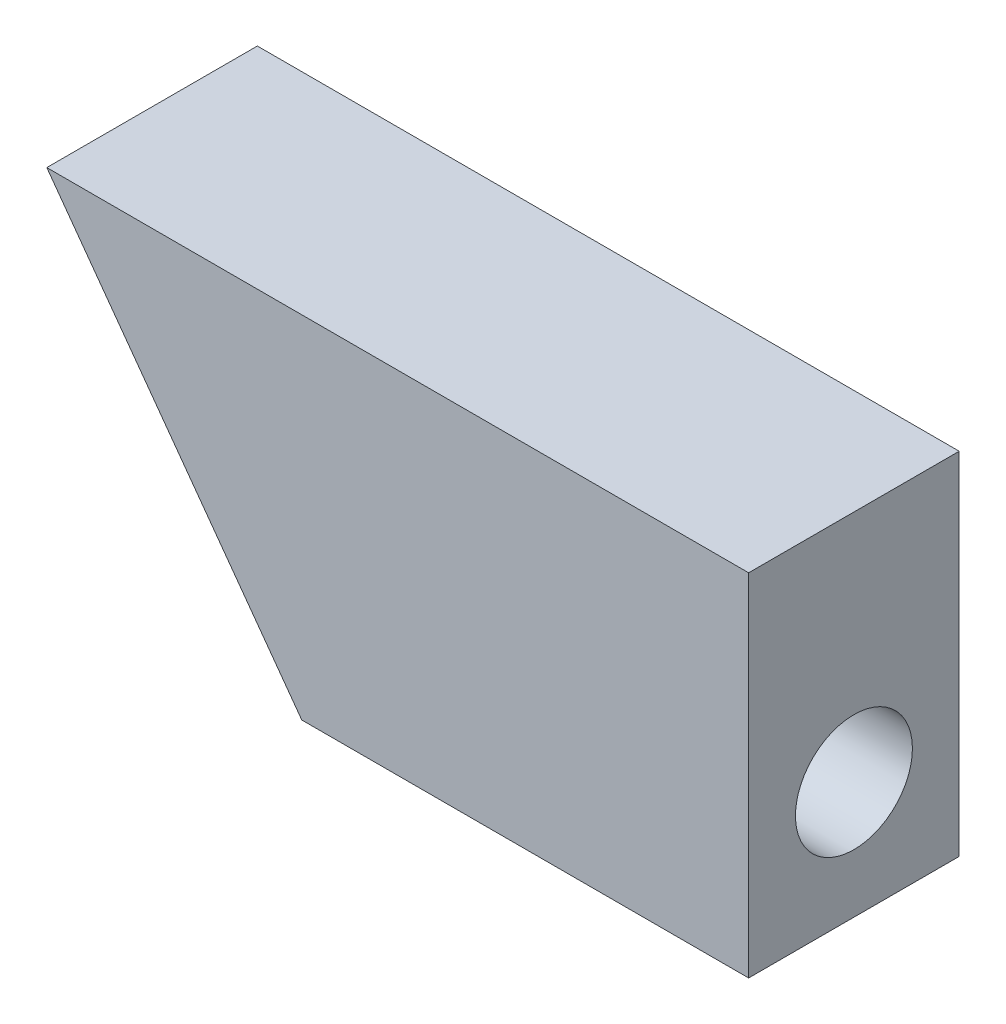
ISO-10303-21;
HEADER;
FILE_DESCRIPTION(('STEP AP214'),'2;1');
FILE_NAME('part.step','',(''),(''),'','','');
FILE_SCHEMA(('AUTOMOTIVE_DESIGN { 1 0 10303 214 1 1 1 1 }'));
ENDSEC;
DATA;
#1=APPLICATION_CONTEXT('core data for automotive mechanical design processes');
#2=APPLICATION_PROTOCOL_DEFINITION('international standard','automotive_design',2000,#1);
#3=PRODUCT_CONTEXT('',#1,'mechanical');
#4=PRODUCT('Part','Part','',(#3));
#5=PRODUCT_RELATED_PRODUCT_CATEGORY('part','',(#4));
#6=PRODUCT_DEFINITION_FORMATION('','',#4);
#7=PRODUCT_DEFINITION_CONTEXT('part definition',#1,'design');
#8=PRODUCT_DEFINITION('design','',#6,#7);
#9=PRODUCT_DEFINITION_SHAPE('','',#8);
#10=(LENGTH_UNIT() NAMED_UNIT(*) SI_UNIT(.MILLI.,.METRE.));
#11=(NAMED_UNIT(*) PLANE_ANGLE_UNIT() SI_UNIT($,.RADIAN.));
#12=(NAMED_UNIT(*) SI_UNIT($,.STERADIAN.) SOLID_ANGLE_UNIT());
#13=UNCERTAINTY_MEASURE_WITH_UNIT(LENGTH_MEASURE(1.E-05),#10,'distance_accuracy_value','');
#14=(GEOMETRIC_REPRESENTATION_CONTEXT(3) GLOBAL_UNCERTAINTY_ASSIGNED_CONTEXT((#13)) GLOBAL_UNIT_ASSIGNED_CONTEXT((#10,
#11,#12)) REPRESENTATION_CONTEXT('',''));
#15=CARTESIAN_POINT('',(0.,0.,0.));
#16=DIRECTION('',(0.,0.,1.));
#17=DIRECTION('',(1.,0.,0.));
#18=AXIS2_PLACEMENT_3D('',#15,#16,#17);
#19=CARTESIAN_POINT('',(19.1018620799197,15.,9.));
#20=DIRECTION('',(-1.,0.,0.));
#21=DIRECTION('',(0.,0.,1.));
#22=AXIS2_PLACEMENT_3D('',#19,#20,#21);
#23=PLANE('',#22);
#24=CARTESIAN_POINT('',(19.1018620799197,5.,4.5));
#25=DIRECTION('',(1.,0.,0.));
#26=DIRECTION('',(0.,0.,-1.));
#27=AXIS2_PLACEMENT_3D('',#24,#25,#26);
#28=CIRCLE('',#27,2.5);
#29=CARTESIAN_POINT('',(19.1018620799197,5.,2.));
#30=VERTEX_POINT('',#29);
#31=EDGE_CURVE('E116',#30,#30,#28,.T.);
#32=ORIENTED_EDGE('',*,*,#31,.F.);
#33=EDGE_LOOP('',(#32));
#34=FACE_BOUND('',#33,.T.);
#35=DIRECTION('',(0.,1.,0.));
#36=VECTOR('',#35,1.);
#37=CARTESIAN_POINT('',(19.1018620799197,15.,0.));
#38=LINE('',#37,#36);
#39=CARTESIAN_POINT('',(19.1018620799197,0.,0.));
#40=VERTEX_POINT('',#39);
#41=CARTESIAN_POINT('',(19.1018620799197,15.,0.));
#42=VERTEX_POINT('',#41);
#43=EDGE_CURVE('E103',#40,#42,#38,.T.);
#44=ORIENTED_EDGE('',*,*,#43,.T.);
#45=DIRECTION('',(0.,0.,-1.));
#46=VECTOR('',#45,1.);
#47=CARTESIAN_POINT('',(19.1018620799197,15.,9.));
#48=LINE('',#47,#46);
#49=CARTESIAN_POINT('',(19.1018620799197,15.,9.));
#50=VERTEX_POINT('',#49);
#51=EDGE_CURVE('E11',#50,#42,#48,.T.);
#52=ORIENTED_EDGE('',*,*,#51,.F.);
#53=DIRECTION('',(0.,1.,0.));
#54=VECTOR('',#53,1.);
#55=CARTESIAN_POINT('',(19.1018620799197,15.,9.));
#56=LINE('',#55,#54);
#57=CARTESIAN_POINT('',(19.1018620799197,0.,9.));
#58=VERTEX_POINT('',#57);
#59=EDGE_CURVE('E90',#58,#50,#56,.T.);
#60=ORIENTED_EDGE('',*,*,#59,.F.);
#61=DIRECTION('',(0.,0.,-1.));
#62=VECTOR('',#61,1.);
#63=CARTESIAN_POINT('',(19.1018620799197,0.,9.));
#64=LINE('',#63,#62);
#65=EDGE_CURVE('E99',#58,#40,#64,.T.);
#66=ORIENTED_EDGE('',*,*,#65,.T.);
#67=EDGE_LOOP('',(#44,#52,#60,#66));
#68=FACE_BOUND('',#67,.T.);
#69=ADVANCED_FACE('F38',(#34,#68),#23,.F.);
#70=CARTESIAN_POINT('',(-10.8981379200803,15.,9.));
#71=DIRECTION('',(0.,-1.,0.));
#72=DIRECTION('',(1.,0.,0.));
#73=AXIS2_PLACEMENT_3D('',#70,#71,#72);
#74=PLANE('',#73);
#75=DIRECTION('',(-1.,0.,0.));
#76=VECTOR('',#75,1.);
#77=CARTESIAN_POINT('',(-10.8981379200803,15.,0.));
#78=LINE('',#77,#76);
#79=CARTESIAN_POINT('',(-10.8981379200803,15.,0.));
#80=VERTEX_POINT('',#79);
#81=EDGE_CURVE('E94',#42,#80,#78,.T.);
#82=ORIENTED_EDGE('',*,*,#81,.T.);
#83=DIRECTION('',(0.,0.,-1.));
#84=VECTOR('',#83,1.);
#85=CARTESIAN_POINT('',(-10.8981379200803,15.,9.));
#86=LINE('',#85,#84);
#87=CARTESIAN_POINT('',(-10.8981379200803,15.,9.));
#88=VERTEX_POINT('',#87);
#89=EDGE_CURVE('E47',#88,#80,#86,.T.);
#90=ORIENTED_EDGE('',*,*,#89,.F.);
#91=DIRECTION('',(-1.,0.,0.));
#92=VECTOR('',#91,1.);
#93=CARTESIAN_POINT('',(-10.8981379200803,15.,9.));
#94=LINE('',#93,#92);
#95=EDGE_CURVE('E85',#50,#88,#94,.T.);
#96=ORIENTED_EDGE('',*,*,#95,.F.);
#97=ORIENTED_EDGE('',*,*,#51,.T.);
#98=EDGE_LOOP('',(#82,#90,#96,#97));
#99=FACE_BOUND('',#98,.T.);
#100=ADVANCED_FACE('F93',(#99),#74,.F.);
#101=CARTESIAN_POINT('',(0.,0.,9.));
#102=DIRECTION('',(0.809016994374951,0.587785252292469,0.));
#103=DIRECTION('',(-0.587785252292469,0.809016994374951,0.));
#104=AXIS2_PLACEMENT_3D('',#101,#102,#103);
#105=PLANE('',#104);
#106=CARTESIAN_POINT('',(-3.63271264002676,5.,4.5));
#107=DIRECTION('',(0.809016994374951,0.587785252292469,0.));
#108=DIRECTION('',(0.587785252292469,-0.809016994374951,0.));
#109=AXIS2_PLACEMENT_3D('',#106,#107,#108);
#110=ELLIPSE('',#109,3.09016994374947,2.5);
#111=CARTESIAN_POINT('',(-1.81635632001338,2.5,4.5));
#112=VERTEX_POINT('',#111);
#113=EDGE_CURVE('E41',#112,#112,#110,.T.);
#114=ORIENTED_EDGE('',*,*,#113,.T.);
#115=EDGE_LOOP('',(#114));
#116=FACE_BOUND('',#115,.T.);
#117=DIRECTION('',(0.587785252292469,-0.809016994374951,0.));
#118=VECTOR('',#117,1.);
#119=CARTESIAN_POINT('',(0.,0.,0.));
#120=LINE('',#119,#118);
#121=CARTESIAN_POINT('',(0.,0.,0.));
#122=VERTEX_POINT('',#121);
#123=EDGE_CURVE('E72',#80,#122,#120,.T.);
#124=ORIENTED_EDGE('',*,*,#123,.T.);
#125=DIRECTION('',(0.,0.,-1.));
#126=VECTOR('',#125,1.);
#127=CARTESIAN_POINT('',(0.,0.,9.));
#128=LINE('',#127,#126);
#129=CARTESIAN_POINT('',(0.,0.,9.));
#130=VERTEX_POINT('',#129);
#131=EDGE_CURVE('E95',#130,#122,#128,.T.);
#132=ORIENTED_EDGE('',*,*,#131,.F.);
#133=DIRECTION('',(0.587785252292469,-0.809016994374951,0.));
#134=VECTOR('',#133,1.);
#135=CARTESIAN_POINT('',(0.,0.,9.));
#136=LINE('',#135,#134);
#137=EDGE_CURVE('E88',#88,#130,#136,.T.);
#138=ORIENTED_EDGE('',*,*,#137,.F.);
#139=ORIENTED_EDGE('',*,*,#89,.T.);
#140=EDGE_LOOP('',(#124,#132,#138,#139));
#141=FACE_BOUND('',#140,.T.);
#142=ADVANCED_FACE('F97',(#116,#141),#105,.F.);
#143=CARTESIAN_POINT('',(19.1018620799197,0.,9.));
#144=DIRECTION('',(0.,1.,0.));
#145=DIRECTION('',(-1.,0.,0.));
#146=AXIS2_PLACEMENT_3D('',#143,#144,#145);
#147=PLANE('',#146);
#148=DIRECTION('',(1.,0.,0.));
#149=VECTOR('',#148,1.);
#150=CARTESIAN_POINT('',(19.1018620799197,0.,0.));
#151=LINE('',#150,#149);
#152=EDGE_CURVE('E78',#122,#40,#151,.T.);
#153=ORIENTED_EDGE('',*,*,#152,.T.);
#154=ORIENTED_EDGE('',*,*,#65,.F.);
#155=DIRECTION('',(1.,0.,0.));
#156=VECTOR('',#155,1.);
#157=CARTESIAN_POINT('',(19.1018620799197,0.,9.));
#158=LINE('',#157,#156);
#159=EDGE_CURVE('E55',#130,#58,#158,.T.);
#160=ORIENTED_EDGE('',*,*,#159,.F.);
#161=ORIENTED_EDGE('',*,*,#131,.T.);
#162=EDGE_LOOP('',(#153,#154,#160,#161));
#163=FACE_BOUND('',#162,.T.);
#164=ADVANCED_FACE('F110',(#163),#147,.F.);
#165=CARTESIAN_POINT('',(0.,0.,9.));
#166=DIRECTION('',(0.,0.,-1.));
#167=DIRECTION('',(-1.,0.,0.));
#168=AXIS2_PLACEMENT_3D('',#165,#166,#167);
#169=PLANE('',#168);
#170=ORIENTED_EDGE('',*,*,#59,.T.);
#171=ORIENTED_EDGE('',*,*,#95,.T.);
#172=ORIENTED_EDGE('',*,*,#137,.T.);
#173=ORIENTED_EDGE('',*,*,#159,.T.);
#174=EDGE_LOOP('',(#170,#171,#172,#173));
#175=FACE_BOUND('',#174,.T.);
#176=ADVANCED_FACE('F86',(#175),#169,.F.);
#177=CARTESIAN_POINT('',(0.,0.,0.));
#178=DIRECTION('',(0.,0.,-1.));
#179=DIRECTION('',(-1.,0.,0.));
#180=AXIS2_PLACEMENT_3D('',#177,#178,#179);
#181=PLANE('',#180);
#182=ORIENTED_EDGE('',*,*,#43,.F.);
#183=ORIENTED_EDGE('',*,*,#152,.F.);
#184=ORIENTED_EDGE('',*,*,#123,.F.);
#185=ORIENTED_EDGE('',*,*,#81,.F.);
#186=EDGE_LOOP('',(#182,#183,#184,#185));
#187=FACE_BOUND('',#186,.T.);
#188=ADVANCED_FACE('F113',(#187),#181,.T.);
#189=CARTESIAN_POINT('',(-10.8981379200803,5.,4.5));
#190=DIRECTION('',(1.,0.,0.));
#191=DIRECTION('',(0.,0.,-1.));
#192=AXIS2_PLACEMENT_3D('',#189,#190,#191);
#193=CYLINDRICAL_SURFACE('',#192,2.5);
#194=ORIENTED_EDGE('',*,*,#31,.T.);
#195=EDGE_LOOP('',(#194));
#196=FACE_BOUND('',#195,.T.);
#197=ORIENTED_EDGE('',*,*,#113,.F.);
#198=EDGE_LOOP('',(#197));
#199=FACE_BOUND('',#198,.T.);
#200=ADVANCED_FACE('F124',(#196,#199),#193,.F.);
#201=CLOSED_SHELL('',(#69,#100,#142,#164,#176,#188,#200));
#202=MANIFOLD_SOLID_BREP('B2',#201);
#203=ADVANCED_BREP_SHAPE_REPRESENTATION('',(#18,#202),#14);
#204=SHAPE_DEFINITION_REPRESENTATION(#9,#203);
ENDSEC;
END-ISO-10303-21;
